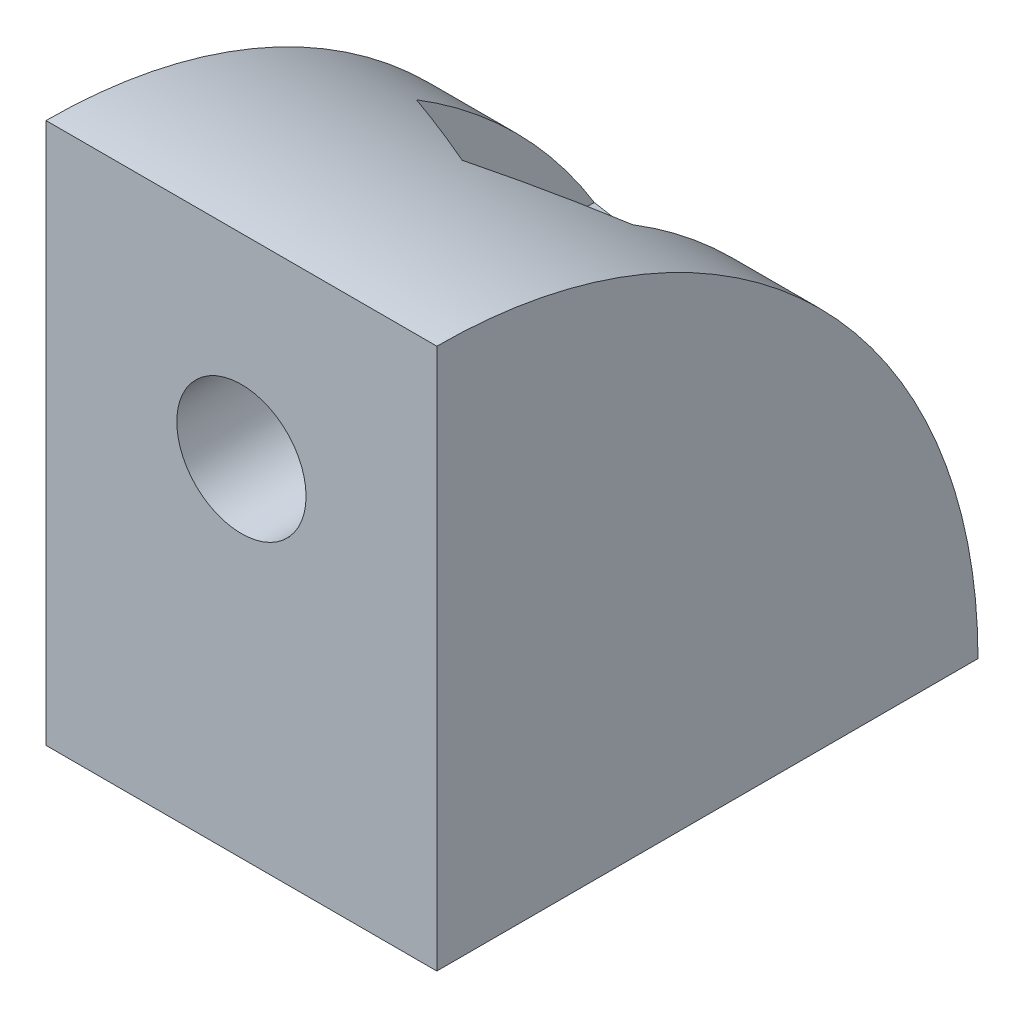
ISO-10303-21;
HEADER;
FILE_DESCRIPTION(('STEP AP214'),'2;1');
FILE_NAME('part.step','',(''),(''),'','','');
FILE_SCHEMA(('AUTOMOTIVE_DESIGN { 1 0 10303 214 1 1 1 1 }'));
ENDSEC;
DATA;
#1=APPLICATION_CONTEXT('core data for automotive mechanical design processes');
#2=APPLICATION_PROTOCOL_DEFINITION('international standard','automotive_design',2000,#1);
#3=PRODUCT_CONTEXT('',#1,'mechanical');
#4=PRODUCT('Part','Part','',(#3));
#5=PRODUCT_RELATED_PRODUCT_CATEGORY('part','',(#4));
#6=PRODUCT_DEFINITION_FORMATION('','',#4);
#7=PRODUCT_DEFINITION_CONTEXT('part definition',#1,'design');
#8=PRODUCT_DEFINITION('design','',#6,#7);
#9=PRODUCT_DEFINITION_SHAPE('','',#8);
#10=(LENGTH_UNIT() NAMED_UNIT(*) SI_UNIT(.MILLI.,.METRE.));
#11=(NAMED_UNIT(*) PLANE_ANGLE_UNIT() SI_UNIT($,.RADIAN.));
#12=(NAMED_UNIT(*) SI_UNIT($,.STERADIAN.) SOLID_ANGLE_UNIT());
#13=UNCERTAINTY_MEASURE_WITH_UNIT(LENGTH_MEASURE(1.E-05),#10,'distance_accuracy_value','');
#14=(GEOMETRIC_REPRESENTATION_CONTEXT(3) GLOBAL_UNCERTAINTY_ASSIGNED_CONTEXT((#13)) GLOBAL_UNIT_ASSIGNED_CONTEXT((#10,
#11,#12)) REPRESENTATION_CONTEXT('',''));
#15=CARTESIAN_POINT('',(0.,0.,0.));
#16=DIRECTION('',(0.,0.,1.));
#17=DIRECTION('',(1.,0.,0.));
#18=AXIS2_PLACEMENT_3D('',#15,#16,#17);
#19=CARTESIAN_POINT('',(13.,0.,0.));
#20=DIRECTION('',(-1.,0.,0.));
#21=DIRECTION('',(0.,0.,1.));
#22=AXIS2_PLACEMENT_3D('',#19,#20,#21);
#23=CYLINDRICAL_SURFACE('',#22,18.);
#24=CARTESIAN_POINT('',(0.,0.,0.));
#25=DIRECTION('',(1.,0.,0.));
#26=DIRECTION('',(0.,0.,-1.));
#27=AXIS2_PLACEMENT_3D('',#24,#25,#26);
#28=CIRCLE('',#27,18.);
#29=CARTESIAN_POINT('',(0.,0.,-18.));
#30=VERTEX_POINT('',#29);
#31=CARTESIAN_POINT('',(0.,18.,0.));
#32=VERTEX_POINT('',#31);
#33=EDGE_CURVE('E265',#30,#32,#28,.T.);
#34=ORIENTED_EDGE('',*,*,#33,.T.);
#35=DIRECTION('',(-1.,0.,0.));
#36=VECTOR('',#35,1.);
#37=CARTESIAN_POINT('',(13.,18.,0.));
#38=LINE('',#37,#36);
#39=CARTESIAN_POINT('',(13.,18.,0.));
#40=VERTEX_POINT('',#39);
#41=EDGE_CURVE('E269',#40,#32,#38,.T.);
#42=ORIENTED_EDGE('',*,*,#41,.F.);
#43=CARTESIAN_POINT('',(13.,0.,0.));
#44=DIRECTION('',(1.,0.,0.));
#45=DIRECTION('',(0.,0.,-1.));
#46=AXIS2_PLACEMENT_3D('',#43,#44,#45);
#47=CIRCLE('',#46,18.);
#48=CARTESIAN_POINT('',(13.,0.,-18.));
#49=VERTEX_POINT('',#48);
#50=EDGE_CURVE('E267',#49,#40,#47,.T.);
#51=ORIENTED_EDGE('',*,*,#50,.F.);
#52=DIRECTION('',(-1.,0.,0.));
#53=VECTOR('',#52,1.);
#54=CARTESIAN_POINT('',(13.,0.,-18.));
#55=LINE('',#54,#53);
#56=EDGE_CURVE('E277',#49,#30,#55,.T.);
#57=ORIENTED_EDGE('',*,*,#56,.T.);
#58=EDGE_LOOP('',(#34,#42,#51,#57));
#59=FACE_BOUND('',#58,.T.);
#60=CARTESIAN_POINT('',(19.2185842870421,0.,0.));
#61=DIRECTION('',(0.5,0.,-0.866025403784439));
#62=DIRECTION('',(-0.866025403784439,0.,-0.5));
#63=AXIS2_PLACEMENT_3D('',#60,#61,#62);
#64=ELLIPSE('',#63,36.,18.);
#65=CARTESIAN_POINT('',(2.89999999999999,15.3373596909279,-9.42153903091734));
#66=VERTEX_POINT('',#65);
#67=CARTESIAN_POINT('',(6.5,16.4340866669798,-7.34307806183468));
#68=VERTEX_POINT('',#67);
#69=EDGE_CURVE('E210',#66,#68,#64,.T.);
#70=ORIENTED_EDGE('',*,*,#69,.F.);
#71=CARTESIAN_POINT('',(2.89999999999999,0.,0.));
#72=DIRECTION('',(-1.,0.,0.));
#73=DIRECTION('',(0.,-1.,0.));
#74=AXIS2_PLACEMENT_3D('',#71,#72,#73);
#75=CIRCLE('',#74,18.);
#76=CARTESIAN_POINT('',(2.89999999999999,9.42153903091735,-15.3373596909279));
#77=VERTEX_POINT('',#76);
#78=EDGE_CURVE('E283',#66,#77,#75,.T.);
#79=ORIENTED_EDGE('',*,*,#78,.T.);
#80=CARTESIAN_POINT('',(19.2185842870421,0.,0.));
#81=DIRECTION('',(-0.5,-0.866025403784439,0.));
#82=DIRECTION('',(-0.866025403784439,0.5,0.));
#83=AXIS2_PLACEMENT_3D('',#80,#81,#82);
#84=ELLIPSE('',#83,36.,18.);
#85=CARTESIAN_POINT('',(6.5,7.34307806183469,-16.4340866669798));
#86=VERTEX_POINT('',#85);
#87=EDGE_CURVE('E287',#77,#86,#84,.T.);
#88=ORIENTED_EDGE('',*,*,#87,.T.);
#89=CARTESIAN_POINT('',(-6.21858428704208,0.,0.));
#90=DIRECTION('',(0.5,-0.866025403784439,0.));
#91=DIRECTION('',(-0.866025403784439,-0.5,0.));
#92=AXIS2_PLACEMENT_3D('',#89,#90,#91);
#93=ELLIPSE('',#92,36.,18.);
#94=CARTESIAN_POINT('',(10.1,9.42153903091735,-15.3373596909279));
#95=VERTEX_POINT('',#94);
#96=EDGE_CURVE('E290',#86,#95,#93,.T.);
#97=ORIENTED_EDGE('',*,*,#96,.T.);
#98=CARTESIAN_POINT('',(10.1,0.,0.));
#99=DIRECTION('',(1.,0.,0.));
#100=DIRECTION('',(0.,0.,-1.));
#101=AXIS2_PLACEMENT_3D('',#98,#99,#100);
#102=CIRCLE('',#101,18.);
#103=CARTESIAN_POINT('',(10.1,15.3373596909279,-9.42153903091734));
#104=VERTEX_POINT('',#103);
#105=EDGE_CURVE('E293',#95,#104,#102,.T.);
#106=ORIENTED_EDGE('',*,*,#105,.T.);
#107=CARTESIAN_POINT('',(-6.21858428704208,0.,0.));
#108=DIRECTION('',(-0.5,0.,-0.866025403784439));
#109=DIRECTION('',(-0.866025403784439,0.,0.5));
#110=AXIS2_PLACEMENT_3D('',#107,#108,#109);
#111=ELLIPSE('',#110,36.,18.);
#112=EDGE_CURVE('E216',#68,#104,#111,.T.);
#113=ORIENTED_EDGE('',*,*,#112,.F.);
#114=EDGE_LOOP('',(#70,#79,#88,#97,#106,#113));
#115=FACE_BOUND('',#114,.T.);
#116=ADVANCED_FACE('F46',(#59,#115),#23,.T.);
#117=CARTESIAN_POINT('',(10.1,13.5784609690827,-34.));
#118=DIRECTION('',(0.5,0.866025403784439,0.));
#119=DIRECTION('',(-0.866025403784439,0.5,0.));
#120=AXIS2_PLACEMENT_3D('',#117,#118,#119);
#121=PLANE('',#120);
#122=DIRECTION('',(-0.774596669241483,0.447213595499958,0.447213595499958));
#123=VECTOR('',#122,1.);
#124=CARTESIAN_POINT('',(18.61422863406,8.66276877526614,-14.3372312247339));
#125=LINE('',#124,#123);
#126=CARTESIAN_POINT('',(10.1,13.5784609690827,-9.42153903091734));
#127=VERTEX_POINT('',#126);
#128=CARTESIAN_POINT('',(6.5,15.6569219381653,-7.34307806183468));
#129=VERTEX_POINT('',#128);
#130=EDGE_CURVE('E214',#127,#129,#125,.T.);
#131=ORIENTED_EDGE('',*,*,#130,.F.);
#132=DIRECTION('',(0.,0.,1.));
#133=VECTOR('',#132,1.);
#134=CARTESIAN_POINT('',(10.1,13.5784609690827,-34.));
#135=LINE('',#134,#133);
#136=CARTESIAN_POINT('',(10.1,13.5784609690827,-4.));
#137=VERTEX_POINT('',#136);
#138=EDGE_CURVE('E241',#127,#137,#135,.T.);
#139=ORIENTED_EDGE('',*,*,#138,.T.);
#140=DIRECTION('',(-0.866025403784439,0.5,0.));
#141=VECTOR('',#140,1.);
#142=CARTESIAN_POINT('',(10.1,13.5784609690827,-4.));
#143=LINE('',#142,#141);
#144=CARTESIAN_POINT('',(6.5,15.6569219381653,-4.));
#145=VERTEX_POINT('',#144);
#146=EDGE_CURVE('E222',#137,#145,#143,.T.);
#147=ORIENTED_EDGE('',*,*,#146,.T.);
#148=DIRECTION('',(0.,0.,1.));
#149=VECTOR('',#148,1.);
#150=CARTESIAN_POINT('',(6.5,15.6569219381653,-34.));
#151=LINE('',#150,#149);
#152=EDGE_CURVE('E240',#129,#145,#151,.T.);
#153=ORIENTED_EDGE('',*,*,#152,.F.);
#154=EDGE_LOOP('',(#131,#139,#147,#153));
#155=FACE_BOUND('',#154,.T.);
#156=ADVANCED_FACE('F317',(#155),#121,.F.);
#157=CARTESIAN_POINT('',(6.5,7.34307806183469,-34.));
#158=DIRECTION('',(0.5,-0.866025403784439,0.));
#159=DIRECTION('',(0.866025403784439,0.5,0.));
#160=AXIS2_PLACEMENT_3D('',#157,#158,#159);
#161=PLANE('',#160);
#162=DIRECTION('',(-0.774596669241483,-0.447213595499958,-0.447213595499958));
#163=VECTOR('',#162,1.);
#164=CARTESIAN_POINT('',(0.14577136594006,3.67446244946775,-19.3255375505323));
#165=LINE('',#164,#163);
#166=CARTESIAN_POINT('',(10.1,9.42153903091734,-13.5784609690827));
#167=VERTEX_POINT('',#166);
#168=CARTESIAN_POINT('',(6.5,7.34307806183469,-15.6569219381653));
#169=VERTEX_POINT('',#168);
#170=EDGE_CURVE('E13',#167,#169,#165,.T.);
#171=ORIENTED_EDGE('',*,*,#170,.F.);
#172=DIRECTION('',(0.,0.,1.));
#173=VECTOR('',#172,1.);
#174=CARTESIAN_POINT('',(10.1,9.42153903091735,-34.));
#175=LINE('',#174,#173);
#176=EDGE_CURVE('E168',#95,#167,#175,.T.);
#177=ORIENTED_EDGE('',*,*,#176,.F.);
#178=ORIENTED_EDGE('',*,*,#96,.F.);
#179=DIRECTION('',(0.,0.,1.));
#180=VECTOR('',#179,1.);
#181=CARTESIAN_POINT('',(6.5,7.34307806183469,-34.));
#182=LINE('',#181,#180);
#183=EDGE_CURVE('E246',#86,#169,#182,.T.);
#184=ORIENTED_EDGE('',*,*,#183,.T.);
#185=EDGE_LOOP('',(#171,#177,#178,#184));
#186=FACE_BOUND('',#185,.T.);
#187=ADVANCED_FACE('F343',(#186),#161,.F.);
#188=DIRECTION('',(0.774596669241483,0.447213595499958,-0.447213595499958));
#189=VECTOR('',#188,1.);
#190=CARTESIAN_POINT('',(15.7342286340599,12.6744624494678,-12.6744624494677));
#191=LINE('',#190,#189);
#192=CARTESIAN_POINT('',(6.5,7.34307806183469,-7.34307806183469));
#193=VERTEX_POINT('',#192);
#194=CARTESIAN_POINT('',(10.1,9.42153903091734,-9.42153903091734));
#195=VERTEX_POINT('',#194);
#196=EDGE_CURVE('E54',#193,#195,#191,.T.);
#197=ORIENTED_EDGE('',*,*,#196,.F.);
#198=CARTESIAN_POINT('',(6.5,7.34307806183469,-4.));
#199=VERTEX_POINT('',#198);
#200=EDGE_CURVE('E249',#193,#199,#182,.T.);
#201=ORIENTED_EDGE('',*,*,#200,.T.);
#202=DIRECTION('',(0.866025403784439,0.5,0.));
#203=VECTOR('',#202,1.);
#204=CARTESIAN_POINT('',(6.5,7.34307806183469,-4.));
#205=LINE('',#204,#203);
#206=CARTESIAN_POINT('',(10.1,9.42153903091735,-4.));
#207=VERTEX_POINT('',#206);
#208=EDGE_CURVE('E234',#199,#207,#205,.T.);
#209=ORIENTED_EDGE('',*,*,#208,.T.);
#210=EDGE_CURVE('E245',#195,#207,#175,.T.);
#211=ORIENTED_EDGE('',*,*,#210,.F.);
#212=EDGE_LOOP('',(#197,#201,#209,#211));
#213=FACE_BOUND('',#212,.T.);
#214=ADVANCED_FACE('F305',(#213),#161,.F.);
#215=CARTESIAN_POINT('',(2.89999999999999,9.42153903091735,-34.));
#216=DIRECTION('',(-0.5,-0.866025403784439,0.));
#217=DIRECTION('',(0.866025403784439,-0.5,0.));
#218=AXIS2_PLACEMENT_3D('',#215,#216,#217);
#219=PLANE('',#218);
#220=DIRECTION('',(-0.774596669241483,0.447213595499958,0.447213595499959));
#221=VECTOR('',#220,1.);
#222=CARTESIAN_POINT('',(9.97422863405995,5.33723122473387,-17.6627687752661));
#223=LINE('',#222,#221);
#224=CARTESIAN_POINT('',(2.89999999999999,9.42153903091735,-13.5784609690827));
#225=VERTEX_POINT('',#224);
#226=EDGE_CURVE('E212',#169,#225,#223,.T.);
#227=ORIENTED_EDGE('',*,*,#226,.F.);
#228=ORIENTED_EDGE('',*,*,#183,.F.);
#229=ORIENTED_EDGE('',*,*,#87,.F.);
#230=DIRECTION('',(0.,0.,1.));
#231=VECTOR('',#230,1.);
#232=CARTESIAN_POINT('',(2.89999999999999,9.42153903091735,-34.));
#233=LINE('',#232,#231);
#234=EDGE_CURVE('E250',#77,#225,#233,.T.);
#235=ORIENTED_EDGE('',*,*,#234,.T.);
#236=EDGE_LOOP('',(#227,#228,#229,#235));
#237=FACE_BOUND('',#236,.T.);
#238=ADVANCED_FACE('F341',(#237),#219,.F.);
#239=DIRECTION('',(0.774596669241484,-0.447213595499958,0.447213595499958));
#240=VECTOR('',#239,1.);
#241=CARTESIAN_POINT('',(-5.61422863405995,14.3372312247339,-14.3372312247339));
#242=LINE('',#241,#240);
#243=CARTESIAN_POINT('',(2.89999999999999,9.42153903091735,-9.42153903091734));
#244=VERTEX_POINT('',#243);
#245=EDGE_CURVE('E208',#244,#193,#242,.T.);
#246=ORIENTED_EDGE('',*,*,#245,.F.);
#247=CARTESIAN_POINT('',(2.89999999999999,9.42153903091735,-4.));
#248=VERTEX_POINT('',#247);
#249=EDGE_CURVE('E253',#244,#248,#233,.T.);
#250=ORIENTED_EDGE('',*,*,#249,.T.);
#251=DIRECTION('',(0.866025403784439,-0.5,0.));
#252=VECTOR('',#251,1.);
#253=CARTESIAN_POINT('',(2.89999999999999,9.42153903091735,-4.));
#254=LINE('',#253,#252);
#255=EDGE_CURVE('E231',#248,#199,#254,.T.);
#256=ORIENTED_EDGE('',*,*,#255,.T.);
#257=ORIENTED_EDGE('',*,*,#200,.F.);
#258=EDGE_LOOP('',(#246,#250,#256,#257));
#259=FACE_BOUND('',#258,.T.);
#260=ADVANCED_FACE('F348',(#259),#219,.F.);
#261=CARTESIAN_POINT('',(6.5,15.6569219381653,-34.));
#262=DIRECTION('',(-0.5,0.866025403784438,0.));
#263=DIRECTION('',(-0.866025403784438,-0.500000000000001,0.));
#264=AXIS2_PLACEMENT_3D('',#261,#262,#263);
#265=PLANE('',#264);
#266=DIRECTION('',(-0.774596669241483,-0.447213595499958,-0.447213595499958));
#267=VECTOR('',#266,1.);
#268=CARTESIAN_POINT('',(-2.73422863405995,10.3255375505323,-12.6744624494677));
#269=LINE('',#268,#267);
#270=CARTESIAN_POINT('',(2.89999999999999,13.5784609690827,-9.42153903091734));
#271=VERTEX_POINT('',#270);
#272=EDGE_CURVE('E295',#129,#271,#269,.T.);
#273=ORIENTED_EDGE('',*,*,#272,.F.);
#274=ORIENTED_EDGE('',*,*,#152,.T.);
#275=DIRECTION('',(-0.866025403784438,-0.5,0.));
#276=VECTOR('',#275,1.);
#277=CARTESIAN_POINT('',(6.5,15.6569219381653,-4.));
#278=LINE('',#277,#276);
#279=CARTESIAN_POINT('',(2.89999999999999,13.5784609690827,-4.));
#280=VERTEX_POINT('',#279);
#281=EDGE_CURVE('E225',#145,#280,#278,.T.);
#282=ORIENTED_EDGE('',*,*,#281,.T.);
#283=DIRECTION('',(0.,0.,1.));
#284=VECTOR('',#283,1.);
#285=CARTESIAN_POINT('',(2.89999999999999,13.5784609690827,-34.));
#286=LINE('',#285,#284);
#287=EDGE_CURVE('E254',#271,#280,#286,.T.);
#288=ORIENTED_EDGE('',*,*,#287,.F.);
#289=EDGE_LOOP('',(#273,#274,#282,#288));
#290=FACE_BOUND('',#289,.T.);
#291=ADVANCED_FACE('F325',(#290),#265,.F.);
#292=CARTESIAN_POINT('',(13.,0.,0.));
#293=DIRECTION('',(0.,0.,-1.));
#294=DIRECTION('',(-1.,0.,0.));
#295=AXIS2_PLACEMENT_3D('',#292,#293,#294);
#296=PLANE('',#295);
#297=CARTESIAN_POINT('',(6.5,11.5,0.));
#298=DIRECTION('',(0.,0.,1.));
#299=DIRECTION('',(1.,0.,0.));
#300=AXIS2_PLACEMENT_3D('',#297,#298,#299);
#301=CIRCLE('',#300,2.15);
#302=CARTESIAN_POINT('',(8.65,11.5,0.));
#303=VERTEX_POINT('',#302);
#304=EDGE_CURVE('E257',#303,#303,#301,.T.);
#305=ORIENTED_EDGE('',*,*,#304,.F.);
#306=EDGE_LOOP('',(#305));
#307=FACE_BOUND('',#306,.T.);
#308=DIRECTION('',(0.,-1.,0.));
#309=VECTOR('',#308,1.);
#310=CARTESIAN_POINT('',(0.,0.,0.));
#311=LINE('',#310,#309);
#312=CARTESIAN_POINT('',(0.,0.,0.));
#313=VERTEX_POINT('',#312);
#314=EDGE_CURVE('E260',#32,#313,#311,.T.);
#315=ORIENTED_EDGE('',*,*,#314,.T.);
#316=DIRECTION('',(-1.,0.,0.));
#317=VECTOR('',#316,1.);
#318=CARTESIAN_POINT('',(13.,0.,0.));
#319=LINE('',#318,#317);
#320=CARTESIAN_POINT('',(13.,0.,0.));
#321=VERTEX_POINT('',#320);
#322=EDGE_CURVE('E280',#321,#313,#319,.T.);
#323=ORIENTED_EDGE('',*,*,#322,.F.);
#324=DIRECTION('',(0.,-1.,0.));
#325=VECTOR('',#324,1.);
#326=CARTESIAN_POINT('',(13.,0.,0.));
#327=LINE('',#326,#325);
#328=EDGE_CURVE('E261',#40,#321,#327,.T.);
#329=ORIENTED_EDGE('',*,*,#328,.F.);
#330=ORIENTED_EDGE('',*,*,#41,.T.);
#331=EDGE_LOOP('',(#315,#323,#329,#330));
#332=FACE_BOUND('',#331,.T.);
#333=ADVANCED_FACE('F48',(#307,#332),#296,.F.);
#334=CARTESIAN_POINT('',(13.,0.,0.));
#335=DIRECTION('',(0.,1.,0.));
#336=DIRECTION('',(0.,0.,1.));
#337=AXIS2_PLACEMENT_3D('',#334,#335,#336);
#338=PLANE('',#337);
#339=CARTESIAN_POINT('',(6.5,0.,-11.5));
#340=DIRECTION('',(0.,1.,0.));
#341=DIRECTION('',(1.,0.,0.));
#342=AXIS2_PLACEMENT_3D('',#339,#340,#341);
#343=CIRCLE('',#342,2.15);
#344=CARTESIAN_POINT('',(8.65,0.,-11.5));
#345=VERTEX_POINT('',#344);
#346=EDGE_CURVE('E219',#345,#345,#343,.T.);
#347=ORIENTED_EDGE('',*,*,#346,.T.);
#348=EDGE_LOOP('',(#347));
#349=FACE_BOUND('',#348,.T.);
#350=DIRECTION('',(0.,0.,-1.));
#351=VECTOR('',#350,1.);
#352=CARTESIAN_POINT('',(0.,0.,0.));
#353=LINE('',#352,#351);
#354=EDGE_CURVE('E272',#313,#30,#353,.T.);
#355=ORIENTED_EDGE('',*,*,#354,.T.);
#356=ORIENTED_EDGE('',*,*,#56,.F.);
#357=DIRECTION('',(0.,0.,-1.));
#358=VECTOR('',#357,1.);
#359=CARTESIAN_POINT('',(13.,0.,0.));
#360=LINE('',#359,#358);
#361=EDGE_CURVE('E264',#321,#49,#360,.T.);
#362=ORIENTED_EDGE('',*,*,#361,.F.);
#363=ORIENTED_EDGE('',*,*,#322,.T.);
#364=EDGE_LOOP('',(#355,#356,#362,#363));
#365=FACE_BOUND('',#364,.T.);
#366=ADVANCED_FACE('F372',(#349,#365),#338,.F.);
#367=CARTESIAN_POINT('',(13.,0.,0.));
#368=DIRECTION('',(1.,0.,0.));
#369=DIRECTION('',(0.,0.,-1.));
#370=AXIS2_PLACEMENT_3D('',#367,#368,#369);
#371=PLANE('',#370);
#372=ORIENTED_EDGE('',*,*,#328,.T.);
#373=ORIENTED_EDGE('',*,*,#361,.T.);
#374=ORIENTED_EDGE('',*,*,#50,.T.);
#375=EDGE_LOOP('',(#372,#373,#374));
#376=FACE_BOUND('',#375,.T.);
#377=ADVANCED_FACE('F374',(#376),#371,.T.);
#378=CARTESIAN_POINT('',(0.,0.,0.));
#379=DIRECTION('',(1.,0.,0.));
#380=DIRECTION('',(0.,0.,-1.));
#381=AXIS2_PLACEMENT_3D('',#378,#379,#380);
#382=PLANE('',#381);
#383=ORIENTED_EDGE('',*,*,#314,.F.);
#384=ORIENTED_EDGE('',*,*,#33,.F.);
#385=ORIENTED_EDGE('',*,*,#354,.F.);
#386=EDGE_LOOP('',(#383,#384,#385));
#387=FACE_BOUND('',#386,.T.);
#388=ADVANCED_FACE('F370',(#387),#382,.F.);
#389=CARTESIAN_POINT('',(6.5,11.5,-30.));
#390=DIRECTION('',(0.,0.,1.));
#391=DIRECTION('',(1.,0.,0.));
#392=AXIS2_PLACEMENT_3D('',#389,#390,#391);
#393=CYLINDRICAL_SURFACE('',#392,2.15);
#394=CARTESIAN_POINT('',(6.5,11.5,-4.));
#395=DIRECTION('',(0.,0.,1.));
#396=DIRECTION('',(1.,0.,0.));
#397=AXIS2_PLACEMENT_3D('',#394,#395,#396);
#398=CIRCLE('',#397,2.15);
#399=CARTESIAN_POINT('',(8.65,11.5,-4.));
#400=VERTEX_POINT('',#399);
#401=EDGE_CURVE('E243',#400,#400,#398,.F.);
#402=ORIENTED_EDGE('',*,*,#401,.T.);
#403=EDGE_LOOP('',(#402));
#404=FACE_BOUND('',#403,.T.);
#405=ORIENTED_EDGE('',*,*,#304,.T.);
#406=EDGE_LOOP('',(#405));
#407=FACE_BOUND('',#406,.T.);
#408=ADVANCED_FACE('F394',(#404,#407),#393,.F.);
#409=CARTESIAN_POINT('',(10.1,9.42153903091735,-34.));
#410=DIRECTION('',(1.,0.,0.));
#411=DIRECTION('',(0.,0.,-1.));
#412=AXIS2_PLACEMENT_3D('',#409,#410,#411);
#413=PLANE('',#412);
#414=DIRECTION('',(0.,-1.,0.));
#415=VECTOR('',#414,1.);
#416=CARTESIAN_POINT('',(10.1,34.,-9.42153903091733));
#417=LINE('',#416,#415);
#418=EDGE_CURVE('E206',#104,#127,#417,.T.);
#419=ORIENTED_EDGE('',*,*,#418,.F.);
#420=ORIENTED_EDGE('',*,*,#105,.F.);
#421=ORIENTED_EDGE('',*,*,#176,.T.);
#422=DIRECTION('',(0.,-1.,0.));
#423=VECTOR('',#422,1.);
#424=CARTESIAN_POINT('',(10.1,34.,-13.5784609690827));
#425=LINE('',#424,#423);
#426=CARTESIAN_POINT('',(10.1,4.,-13.5784609690827));
#427=VERTEX_POINT('',#426);
#428=EDGE_CURVE('E161',#167,#427,#425,.T.);
#429=ORIENTED_EDGE('',*,*,#428,.T.);
#430=DIRECTION('',(0.,0.,-1.));
#431=VECTOR('',#430,1.);
#432=CARTESIAN_POINT('',(10.1,4.,-9.42153903091734));
#433=LINE('',#432,#431);
#434=CARTESIAN_POINT('',(10.1,4.,-9.42153903091734));
#435=VERTEX_POINT('',#434);
#436=EDGE_CURVE('E166',#435,#427,#433,.T.);
#437=ORIENTED_EDGE('',*,*,#436,.F.);
#438=EDGE_CURVE('E172',#195,#435,#417,.T.);
#439=ORIENTED_EDGE('',*,*,#438,.F.);
#440=ORIENTED_EDGE('',*,*,#210,.T.);
#441=DIRECTION('',(0.,1.,0.));
#442=VECTOR('',#441,1.);
#443=CARTESIAN_POINT('',(10.1,9.42153903091735,-4.));
#444=LINE('',#443,#442);
#445=EDGE_CURVE('E237',#207,#137,#444,.T.);
#446=ORIENTED_EDGE('',*,*,#445,.T.);
#447=ORIENTED_EDGE('',*,*,#138,.F.);
#448=EDGE_LOOP('',(#419,#420,#421,#429,#437,#439,#440,#446,#447));
#449=FACE_BOUND('',#448,.T.);
#450=ADVANCED_FACE('F164',(#449),#413,.F.);
#451=CARTESIAN_POINT('',(2.89999999999999,13.5784609690827,-34.));
#452=DIRECTION('',(-1.,0.,0.));
#453=DIRECTION('',(0.,-1.,0.));
#454=AXIS2_PLACEMENT_3D('',#451,#452,#453);
#455=PLANE('',#454);
#456=ORIENTED_EDGE('',*,*,#249,.F.);
#457=DIRECTION('',(0.,-1.,0.));
#458=VECTOR('',#457,1.);
#459=CARTESIAN_POINT('',(2.89999999999999,34.,-9.42153903091733));
#460=LINE('',#459,#458);
#461=CARTESIAN_POINT('',(2.89999999999999,4.,-9.42153903091735));
#462=VERTEX_POINT('',#461);
#463=EDGE_CURVE('E61',#244,#462,#460,.T.);
#464=ORIENTED_EDGE('',*,*,#463,.T.);
#465=DIRECTION('',(0.,0.,1.));
#466=VECTOR('',#465,1.);
#467=CARTESIAN_POINT('',(2.89999999999999,4.,-13.5784609690827));
#468=LINE('',#467,#466);
#469=CARTESIAN_POINT('',(2.89999999999999,4.,-13.5784609690827));
#470=VERTEX_POINT('',#469);
#471=EDGE_CURVE('E194',#470,#462,#468,.T.);
#472=ORIENTED_EDGE('',*,*,#471,.F.);
#473=DIRECTION('',(0.,-1.,0.));
#474=VECTOR('',#473,1.);
#475=CARTESIAN_POINT('',(2.89999999999999,34.,-13.5784609690826));
#476=LINE('',#475,#474);
#477=EDGE_CURVE('E200',#225,#470,#476,.T.);
#478=ORIENTED_EDGE('',*,*,#477,.F.);
#479=ORIENTED_EDGE('',*,*,#234,.F.);
#480=ORIENTED_EDGE('',*,*,#78,.F.);
#481=EDGE_CURVE('E202',#66,#271,#460,.T.);
#482=ORIENTED_EDGE('',*,*,#481,.T.);
#483=ORIENTED_EDGE('',*,*,#287,.T.);
#484=DIRECTION('',(0.,-1.,0.));
#485=VECTOR('',#484,1.);
#486=CARTESIAN_POINT('',(2.89999999999999,13.5784609690827,-4.));
#487=LINE('',#486,#485);
#488=EDGE_CURVE('E228',#280,#248,#487,.T.);
#489=ORIENTED_EDGE('',*,*,#488,.T.);
#490=EDGE_LOOP('',(#456,#464,#472,#478,#479,#480,#482,#483,#489));
#491=FACE_BOUND('',#490,.T.);
#492=ADVANCED_FACE('F332',(#491),#455,.F.);
#493=CARTESIAN_POINT('',(0.,0.,-4.));
#494=DIRECTION('',(0.,0.,1.));
#495=DIRECTION('',(1.,0.,0.));
#496=AXIS2_PLACEMENT_3D('',#493,#494,#495);
#497=PLANE('',#496);
#498=ORIENTED_EDGE('',*,*,#146,.F.);
#499=ORIENTED_EDGE('',*,*,#445,.F.);
#500=ORIENTED_EDGE('',*,*,#208,.F.);
#501=ORIENTED_EDGE('',*,*,#255,.F.);
#502=ORIENTED_EDGE('',*,*,#488,.F.);
#503=ORIENTED_EDGE('',*,*,#281,.F.);
#504=EDGE_LOOP('',(#498,#499,#500,#501,#502,#503));
#505=FACE_BOUND('',#504,.T.);
#506=ORIENTED_EDGE('',*,*,#401,.F.);
#507=EDGE_LOOP('',(#506));
#508=FACE_BOUND('',#507,.T.);
#509=ADVANCED_FACE('F311',(#505,#508),#497,.F.);
#510=CARTESIAN_POINT('',(6.5,30.,-11.5));
#511=DIRECTION('',(0.,-1.,0.));
#512=DIRECTION('',(0.,0.,-1.));
#513=AXIS2_PLACEMENT_3D('',#510,#511,#512);
#514=CYLINDRICAL_SURFACE('',#513,2.15);
#515=CARTESIAN_POINT('',(6.5,4.,-11.5));
#516=DIRECTION('',(0.,-1.,0.));
#517=DIRECTION('',(0.,0.,-1.));
#518=AXIS2_PLACEMENT_3D('',#515,#516,#517);
#519=CIRCLE('',#518,2.15);
#520=CARTESIAN_POINT('',(6.5,4.,-13.65));
#521=VERTEX_POINT('',#520);
#522=EDGE_CURVE('E199',#521,#521,#519,.T.);
#523=ORIENTED_EDGE('',*,*,#522,.F.);
#524=EDGE_LOOP('',(#523));
#525=FACE_BOUND('',#524,.T.);
#526=ORIENTED_EDGE('',*,*,#346,.F.);
#527=EDGE_LOOP('',(#526));
#528=FACE_BOUND('',#527,.T.);
#529=ADVANCED_FACE('F357',(#525,#528),#514,.F.);
#530=CARTESIAN_POINT('',(0.,4.,0.));
#531=DIRECTION('',(0.,-1.,0.));
#532=DIRECTION('',(1.,0.,0.));
#533=AXIS2_PLACEMENT_3D('',#530,#531,#532);
#534=PLANE('',#533);
#535=ORIENTED_EDGE('',*,*,#522,.T.);
#536=EDGE_LOOP('',(#535));
#537=FACE_BOUND('',#536,.T.);
#538=DIRECTION('',(-0.866025403784439,0.,-0.5));
#539=VECTOR('',#538,1.);
#540=CARTESIAN_POINT('',(10.1,4.,-13.5784609690827));
#541=LINE('',#540,#539);
#542=CARTESIAN_POINT('',(6.5,4.,-15.6569219381653));
#543=VERTEX_POINT('',#542);
#544=EDGE_CURVE('E180',#427,#543,#541,.T.);
#545=ORIENTED_EDGE('',*,*,#544,.T.);
#546=DIRECTION('',(-0.866025403784438,0.,0.5));
#547=VECTOR('',#546,1.);
#548=CARTESIAN_POINT('',(6.5,4.,-15.6569219381653));
#549=LINE('',#548,#547);
#550=EDGE_CURVE('E173',#543,#470,#549,.T.);
#551=ORIENTED_EDGE('',*,*,#550,.T.);
#552=ORIENTED_EDGE('',*,*,#471,.T.);
#553=DIRECTION('',(0.866025403784439,0.,0.5));
#554=VECTOR('',#553,1.);
#555=CARTESIAN_POINT('',(2.89999999999999,4.,-9.42153903091735));
#556=LINE('',#555,#554);
#557=CARTESIAN_POINT('',(6.5,4.,-7.34307806183469));
#558=VERTEX_POINT('',#557);
#559=EDGE_CURVE('E192',#462,#558,#556,.T.);
#560=ORIENTED_EDGE('',*,*,#559,.T.);
#561=DIRECTION('',(0.866025403784439,0.,-0.5));
#562=VECTOR('',#561,1.);
#563=CARTESIAN_POINT('',(6.5,4.,-7.34307806183469));
#564=LINE('',#563,#562);
#565=EDGE_CURVE('E183',#558,#435,#564,.T.);
#566=ORIENTED_EDGE('',*,*,#565,.T.);
#567=ORIENTED_EDGE('',*,*,#436,.T.);
#568=EDGE_LOOP('',(#545,#551,#552,#560,#566,#567));
#569=FACE_BOUND('',#568,.T.);
#570=ADVANCED_FACE('F178',(#537,#569),#534,.F.);
#571=CARTESIAN_POINT('',(2.89999999999999,34.,-9.42153903091733));
#572=DIRECTION('',(0.5,0.,-0.866025403784439));
#573=DIRECTION('',(-0.866025403784439,0.,-0.5));
#574=AXIS2_PLACEMENT_3D('',#571,#572,#573);
#575=PLANE('',#574);
#576=ORIENTED_EDGE('',*,*,#245,.T.);
#577=DIRECTION('',(0.,-1.,0.));
#578=VECTOR('',#577,1.);
#579=CARTESIAN_POINT('',(6.5,34.,-7.34307806183468));
#580=LINE('',#579,#578);
#581=EDGE_CURVE('E204',#193,#558,#580,.T.);
#582=ORIENTED_EDGE('',*,*,#581,.T.);
#583=ORIENTED_EDGE('',*,*,#559,.F.);
#584=ORIENTED_EDGE('',*,*,#463,.F.);
#585=EDGE_LOOP('',(#576,#582,#583,#584));
#586=FACE_BOUND('',#585,.T.);
#587=ADVANCED_FACE('F349',(#586),#575,.T.);
#588=CARTESIAN_POINT('',(6.5,34.,-15.6569219381653));
#589=DIRECTION('',(0.5,0.,0.866025403784438));
#590=DIRECTION('',(0.866025403784438,0.,-0.500000000000001));
#591=AXIS2_PLACEMENT_3D('',#588,#589,#590);
#592=PLANE('',#591);
#593=ORIENTED_EDGE('',*,*,#226,.T.);
#594=ORIENTED_EDGE('',*,*,#477,.T.);
#595=ORIENTED_EDGE('',*,*,#550,.F.);
#596=DIRECTION('',(0.,-1.,0.));
#597=VECTOR('',#596,1.);
#598=CARTESIAN_POINT('',(6.5,34.,-15.6569219381653));
#599=LINE('',#598,#597);
#600=EDGE_CURVE('E187',#169,#543,#599,.T.);
#601=ORIENTED_EDGE('',*,*,#600,.F.);
#602=EDGE_LOOP('',(#593,#594,#595,#601));
#603=FACE_BOUND('',#602,.T.);
#604=ADVANCED_FACE('F345',(#603),#592,.T.);
#605=CARTESIAN_POINT('',(6.5,34.,-7.34307806183468));
#606=DIRECTION('',(-0.5,0.,-0.866025403784439));
#607=DIRECTION('',(-0.866025403784439,0.,0.5));
#608=AXIS2_PLACEMENT_3D('',#605,#606,#607);
#609=PLANE('',#608);
#610=ORIENTED_EDGE('',*,*,#196,.T.);
#611=ORIENTED_EDGE('',*,*,#438,.T.);
#612=ORIENTED_EDGE('',*,*,#565,.F.);
#613=ORIENTED_EDGE('',*,*,#581,.F.);
#614=EDGE_LOOP('',(#610,#611,#612,#613));
#615=FACE_BOUND('',#614,.T.);
#616=ADVANCED_FACE('F301',(#615),#609,.T.);
#617=CARTESIAN_POINT('',(10.1,34.,-13.5784609690827));
#618=DIRECTION('',(-0.5,0.,0.866025403784439));
#619=DIRECTION('',(0.866025403784439,0.,0.5));
#620=AXIS2_PLACEMENT_3D('',#617,#618,#619);
#621=PLANE('',#620);
#622=ORIENTED_EDGE('',*,*,#170,.T.);
#623=ORIENTED_EDGE('',*,*,#600,.T.);
#624=ORIENTED_EDGE('',*,*,#544,.F.);
#625=ORIENTED_EDGE('',*,*,#428,.F.);
#626=EDGE_LOOP('',(#622,#623,#624,#625));
#627=FACE_BOUND('',#626,.T.);
#628=ADVANCED_FACE('F185',(#627),#621,.T.);
#629=ORIENTED_EDGE('',*,*,#112,.T.);
#630=ORIENTED_EDGE('',*,*,#418,.T.);
#631=ORIENTED_EDGE('',*,*,#130,.T.);
#632=EDGE_CURVE('E69',#68,#129,#580,.T.);
#633=ORIENTED_EDGE('',*,*,#632,.F.);
#634=EDGE_LOOP('',(#629,#630,#631,#633));
#635=FACE_BOUND('',#634,.T.);
#636=ADVANCED_FACE('F321',(#635),#609,.T.);
#637=ORIENTED_EDGE('',*,*,#69,.T.);
#638=ORIENTED_EDGE('',*,*,#632,.T.);
#639=ORIENTED_EDGE('',*,*,#272,.T.);
#640=ORIENTED_EDGE('',*,*,#481,.F.);
#641=EDGE_LOOP('',(#637,#638,#639,#640));
#642=FACE_BOUND('',#641,.T.);
#643=ADVANCED_FACE('F328',(#642),#575,.T.);
#644=CLOSED_SHELL('',(#116,#156,#187,#214,#238,#260,#291,#333,#366,#377,#388,#408,#450,#492,
#509,#529,#570,#587,#604,#616,#628,#636,#643));
#645=MANIFOLD_SOLID_BREP('B2',#644);
#646=ADVANCED_BREP_SHAPE_REPRESENTATION('',(#18,#645),#14);
#647=SHAPE_DEFINITION_REPRESENTATION(#9,#646);
ENDSEC;
END-ISO-10303-21;
